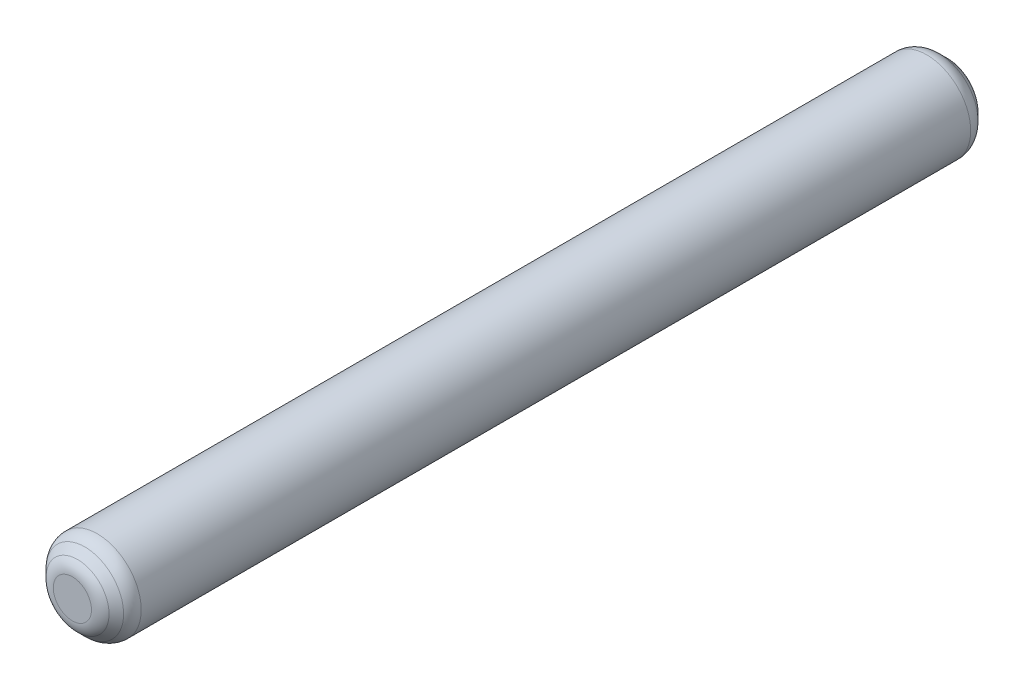
ISO-10303-21;
HEADER;
FILE_DESCRIPTION(('STEP AP214'),'2;1');
FILE_NAME('part.step','',(''),(''),'','','');
FILE_SCHEMA(('AUTOMOTIVE_DESIGN { 1 0 10303 214 1 1 1 1 }'));
ENDSEC;
DATA;
#1=APPLICATION_CONTEXT('core data for automotive mechanical design processes');
#2=APPLICATION_PROTOCOL_DEFINITION('international standard','automotive_design',2000,#1);
#3=PRODUCT_CONTEXT('',#1,'mechanical');
#4=PRODUCT('Part','Part','',(#3));
#5=PRODUCT_RELATED_PRODUCT_CATEGORY('part','',(#4));
#6=PRODUCT_DEFINITION_FORMATION('','',#4);
#7=PRODUCT_DEFINITION_CONTEXT('part definition',#1,'design');
#8=PRODUCT_DEFINITION('design','',#6,#7);
#9=PRODUCT_DEFINITION_SHAPE('','',#8);
#10=(LENGTH_UNIT() NAMED_UNIT(*) SI_UNIT(.MILLI.,.METRE.));
#11=(NAMED_UNIT(*) PLANE_ANGLE_UNIT() SI_UNIT($,.RADIAN.));
#12=(NAMED_UNIT(*) SI_UNIT($,.STERADIAN.) SOLID_ANGLE_UNIT());
#13=UNCERTAINTY_MEASURE_WITH_UNIT(LENGTH_MEASURE(1.E-05),#10,'distance_accuracy_value','');
#14=(GEOMETRIC_REPRESENTATION_CONTEXT(3) GLOBAL_UNCERTAINTY_ASSIGNED_CONTEXT((#13)) GLOBAL_UNIT_ASSIGNED_CONTEXT((#10,
#11,#12)) REPRESENTATION_CONTEXT('',''));
#15=CARTESIAN_POINT('',(0.,0.,0.));
#16=DIRECTION('',(0.,0.,1.));
#17=DIRECTION('',(1.,0.,0.));
#18=AXIS2_PLACEMENT_3D('',#15,#16,#17);
#19=CARTESIAN_POINT('',(0.,0.,10.));
#20=DIRECTION('',(0.,0.,-1.));
#21=DIRECTION('',(-1.,0.,0.));
#22=AXIS2_PLACEMENT_3D('',#19,#20,#21);
#23=CYLINDRICAL_SURFACE('',#22,0.5);
#24=CARTESIAN_POINT('',(0.,0.,9.71715728752538));
#25=DIRECTION('',(0.,0.,1.));
#26=DIRECTION('',(1.,0.,0.));
#27=AXIS2_PLACEMENT_3D('',#24,#25,#26);
#28=CIRCLE('',#27,0.5);
#29=CARTESIAN_POINT('',(0.5,0.,9.71715728752538));
#30=VERTEX_POINT('',#29);
#31=EDGE_CURVE('E10',#30,#30,#28,.F.);
#32=ORIENTED_EDGE('',*,*,#31,.T.);
#33=EDGE_LOOP('',(#32));
#34=FACE_BOUND('',#33,.T.);
#35=CARTESIAN_POINT('',(0.,0.,0.282842712474619));
#36=DIRECTION('',(0.,0.,-1.));
#37=DIRECTION('',(-1.,0.,0.));
#38=AXIS2_PLACEMENT_3D('',#35,#36,#37);
#39=CIRCLE('',#38,0.5);
#40=CARTESIAN_POINT('',(-0.5,0.,0.282842712474619));
#41=VERTEX_POINT('',#40);
#42=EDGE_CURVE('E59',#41,#41,#39,.F.);
#43=ORIENTED_EDGE('',*,*,#42,.T.);
#44=EDGE_LOOP('',(#43));
#45=FACE_BOUND('',#44,.T.);
#46=ADVANCED_FACE('F30',(#34,#45),#23,.T.);
#47=CARTESIAN_POINT('',(0.,0.,10.));
#48=DIRECTION('',(0.,0.,1.));
#49=DIRECTION('',(1.,0.,0.));
#50=AXIS2_PLACEMENT_3D('',#47,#48,#49);
#51=PLANE('',#50);
#52=CARTESIAN_POINT('',(0.,0.,10.));
#53=DIRECTION('',(0.,0.,1.));
#54=DIRECTION('',(1.,0.,0.));
#55=AXIS2_PLACEMENT_3D('',#52,#53,#54);
#56=CIRCLE('',#55,0.217157287525383);
#57=CARTESIAN_POINT('',(0.217157287525383,0.,10.));
#58=VERTEX_POINT('',#57);
#59=EDGE_CURVE('E45',#58,#58,#56,.T.);
#60=ORIENTED_EDGE('',*,*,#59,.T.);
#61=EDGE_LOOP('',(#60));
#62=FACE_BOUND('',#61,.T.);
#63=ADVANCED_FACE('F81',(#62),#51,.T.);
#64=CARTESIAN_POINT('',(0.,0.,0.));
#65=DIRECTION('',(0.,0.,1.));
#66=DIRECTION('',(1.,0.,0.));
#67=AXIS2_PLACEMENT_3D('',#64,#65,#66);
#68=PLANE('',#67);
#69=CARTESIAN_POINT('',(0.,0.,0.));
#70=DIRECTION('',(0.,0.,1.));
#71=DIRECTION('',(1.,0.,0.));
#72=AXIS2_PLACEMENT_3D('',#69,#70,#71);
#73=CIRCLE('',#72,0.217157287525379);
#74=CARTESIAN_POINT('',(0.217157287525379,0.,0.));
#75=VERTEX_POINT('',#74);
#76=EDGE_CURVE('E53',#75,#75,#73,.F.);
#77=ORIENTED_EDGE('',*,*,#76,.T.);
#78=EDGE_LOOP('',(#77));
#79=FACE_BOUND('',#78,.T.);
#80=ADVANCED_FACE('F86',(#79),#68,.F.);
#81=CARTESIAN_POINT('',(0.,0.,0.200000000000001));
#82=DIRECTION('',(0.,0.,1.));
#83=DIRECTION('',(1.,0.,0.));
#84=AXIS2_PLACEMENT_3D('',#81,#82,#83);
#85=CONICAL_SURFACE('',#84,0.5,0.785398163397452);
#86=CARTESIAN_POINT('',(0.,0.,0.05857864376269));
#87=DIRECTION('',(0.,0.,1.));
#88=DIRECTION('',(1.,0.,0.));
#89=AXIS2_PLACEMENT_3D('',#86,#87,#88);
#90=CIRCLE('',#89,0.358578643762688);
#91=CARTESIAN_POINT('',(0.358578643762688,0.,0.05857864376269));
#92=VERTEX_POINT('',#91);
#93=EDGE_CURVE('E50',#92,#92,#90,.T.);
#94=ORIENTED_EDGE('',*,*,#93,.T.);
#95=EDGE_LOOP('',(#94));
#96=FACE_BOUND('',#95,.T.);
#97=CARTESIAN_POINT('',(0.,0.,0.14142135623731));
#98=DIRECTION('',(0.,0.,1.));
#99=DIRECTION('',(1.,0.,0.));
#100=AXIS2_PLACEMENT_3D('',#97,#98,#99);
#101=CIRCLE('',#100,0.441421356237309);
#102=CARTESIAN_POINT('',(0.441421356237309,0.,0.14142135623731));
#103=VERTEX_POINT('',#102);
#104=EDGE_CURVE('E56',#103,#103,#101,.F.);
#105=ORIENTED_EDGE('',*,*,#104,.T.);
#106=EDGE_LOOP('',(#105));
#107=FACE_BOUND('',#106,.T.);
#108=ADVANCED_FACE('F77',(#96,#107),#85,.T.);
#109=CARTESIAN_POINT('',(0.,0.,10.));
#110=DIRECTION('',(0.,0.,-1.));
#111=DIRECTION('',(-1.,0.,0.));
#112=AXIS2_PLACEMENT_3D('',#109,#110,#111);
#113=CONICAL_SURFACE('',#112,0.300000000000002,0.785398163397443);
#114=CARTESIAN_POINT('',(0.,0.,9.94142135623731));
#115=DIRECTION('',(0.,0.,1.));
#116=DIRECTION('',(1.,0.,0.));
#117=AXIS2_PLACEMENT_3D('',#114,#115,#116);
#118=CIRCLE('',#117,0.358578643762693);
#119=CARTESIAN_POINT('',(0.358578643762693,0.,9.94142135623731));
#120=VERTEX_POINT('',#119);
#121=EDGE_CURVE('E37',#120,#120,#118,.F.);
#122=ORIENTED_EDGE('',*,*,#121,.T.);
#123=EDGE_LOOP('',(#122));
#124=FACE_BOUND('',#123,.T.);
#125=CARTESIAN_POINT('',(0.,0.,9.85857864376269));
#126=DIRECTION('',(0.,0.,-1.));
#127=DIRECTION('',(-1.,0.,0.));
#128=AXIS2_PLACEMENT_3D('',#125,#126,#127);
#129=CIRCLE('',#128,0.44142135623731);
#130=CARTESIAN_POINT('',(-0.44142135623731,0.,9.85857864376269));
#131=VERTEX_POINT('',#130);
#132=EDGE_CURVE('E41',#131,#131,#129,.F.);
#133=ORIENTED_EDGE('',*,*,#132,.T.);
#134=EDGE_LOOP('',(#133));
#135=FACE_BOUND('',#134,.T.);
#136=ADVANCED_FACE('F67',(#124,#135),#113,.T.);
#137=CARTESIAN_POINT('',(0.,0.,0.282842712474619));
#138=DIRECTION('',(0.,0.,-1.));
#139=DIRECTION('',(-1.,0.,0.));
#140=AXIS2_PLACEMENT_3D('',#137,#138,#139);
#141=TOROIDAL_SURFACE('',#140,0.3,0.2);
#142=ORIENTED_EDGE('',*,*,#104,.F.);
#143=EDGE_LOOP('',(#142));
#144=FACE_BOUND('',#143,.T.);
#145=ORIENTED_EDGE('',*,*,#42,.F.);
#146=EDGE_LOOP('',(#145));
#147=FACE_BOUND('',#146,.T.);
#148=ADVANCED_FACE('F64',(#144,#147),#141,.T.);
#149=CARTESIAN_POINT('',(0.,0.,0.2));
#150=DIRECTION('',(0.,0.,1.));
#151=DIRECTION('',(1.,0.,0.));
#152=AXIS2_PLACEMENT_3D('',#149,#150,#151);
#153=TOROIDAL_SURFACE('',#152,0.217157287525379,0.2);
#154=ORIENTED_EDGE('',*,*,#93,.F.);
#155=EDGE_LOOP('',(#154));
#156=FACE_BOUND('',#155,.T.);
#157=ORIENTED_EDGE('',*,*,#76,.F.);
#158=EDGE_LOOP('',(#157));
#159=FACE_BOUND('',#158,.T.);
#160=ADVANCED_FACE('F66',(#156,#159),#153,.T.);
#161=CARTESIAN_POINT('',(0.,0.,9.8));
#162=DIRECTION('',(0.,0.,1.));
#163=DIRECTION('',(1.,0.,0.));
#164=AXIS2_PLACEMENT_3D('',#161,#162,#163);
#165=TOROIDAL_SURFACE('',#164,0.217157287525383,0.2);
#166=ORIENTED_EDGE('',*,*,#121,.F.);
#167=EDGE_LOOP('',(#166));
#168=FACE_BOUND('',#167,.T.);
#169=ORIENTED_EDGE('',*,*,#59,.F.);
#170=EDGE_LOOP('',(#169));
#171=FACE_BOUND('',#170,.T.);
#172=ADVANCED_FACE('F74',(#168,#171),#165,.T.);
#173=CARTESIAN_POINT('',(0.,0.,9.71715728752538));
#174=DIRECTION('',(0.,0.,1.));
#175=DIRECTION('',(1.,0.,0.));
#176=AXIS2_PLACEMENT_3D('',#173,#174,#175);
#177=TOROIDAL_SURFACE('',#176,0.3,0.2);
#178=ORIENTED_EDGE('',*,*,#132,.F.);
#179=EDGE_LOOP('',(#178));
#180=FACE_BOUND('',#179,.T.);
#181=ORIENTED_EDGE('',*,*,#31,.F.);
#182=EDGE_LOOP('',(#181));
#183=FACE_BOUND('',#182,.T.);
#184=ADVANCED_FACE('F32',(#180,#183),#177,.T.);
#185=CLOSED_SHELL('',(#46,#63,#80,#108,#136,#148,#160,#172,#184));
#186=MANIFOLD_SOLID_BREP('B2',#185);
#187=ADVANCED_BREP_SHAPE_REPRESENTATION('',(#18,#186),#14);
#188=SHAPE_DEFINITION_REPRESENTATION(#9,#187);
ENDSEC;
END-ISO-10303-21;
